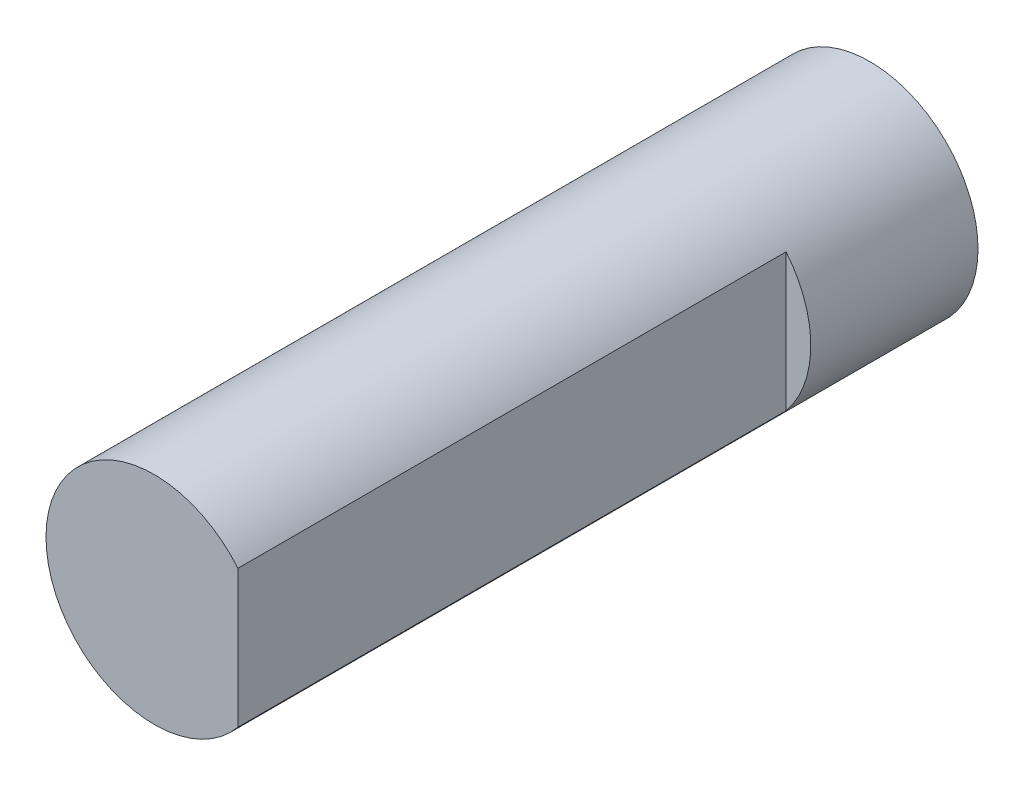
ISO-10303-21;
HEADER;
FILE_DESCRIPTION(('STEP AP214'),'2;1');
FILE_NAME('part.step','',(''),(''),'','','');
FILE_SCHEMA(('AUTOMOTIVE_DESIGN { 1 0 10303 214 1 1 1 1 }'));
ENDSEC;
DATA;
#1=APPLICATION_CONTEXT('core data for automotive mechanical design processes');
#2=APPLICATION_PROTOCOL_DEFINITION('international standard','automotive_design',2000,#1);
#3=PRODUCT_CONTEXT('',#1,'mechanical');
#4=PRODUCT('Part','Part','',(#3));
#5=PRODUCT_RELATED_PRODUCT_CATEGORY('part','',(#4));
#6=PRODUCT_DEFINITION_FORMATION('','',#4);
#7=PRODUCT_DEFINITION_CONTEXT('part definition',#1,'design');
#8=PRODUCT_DEFINITION('design','',#6,#7);
#9=PRODUCT_DEFINITION_SHAPE('','',#8);
#10=(LENGTH_UNIT() NAMED_UNIT(*) SI_UNIT(.MILLI.,.METRE.));
#11=(NAMED_UNIT(*) PLANE_ANGLE_UNIT() SI_UNIT($,.RADIAN.));
#12=(NAMED_UNIT(*) SI_UNIT($,.STERADIAN.) SOLID_ANGLE_UNIT());
#13=UNCERTAINTY_MEASURE_WITH_UNIT(LENGTH_MEASURE(1.E-05),#10,'distance_accuracy_value','');
#14=(GEOMETRIC_REPRESENTATION_CONTEXT(3) GLOBAL_UNCERTAINTY_ASSIGNED_CONTEXT((#13)) GLOBAL_UNIT_ASSIGNED_CONTEXT((#10,
#11,#12)) REPRESENTATION_CONTEXT('',''));
#15=CARTESIAN_POINT('',(0.,0.,0.));
#16=DIRECTION('',(0.,0.,1.));
#17=DIRECTION('',(1.,0.,0.));
#18=AXIS2_PLACEMENT_3D('',#15,#16,#17);
#19=CARTESIAN_POINT('',(0.,0.,67.65));
#20=DIRECTION('',(0.,0.,-1.));
#21=DIRECTION('',(-1.,0.,0.));
#22=AXIS2_PLACEMENT_3D('',#19,#20,#21);
#23=CYLINDRICAL_SURFACE('',#22,1.975);
#24=CARTESIAN_POINT('',(0.,0.,67.65));
#25=DIRECTION('',(0.,0.,1.));
#26=DIRECTION('',(1.,0.,0.));
#27=AXIS2_PLACEMENT_3D('',#24,#25,#26);
#28=CIRCLE('',#27,1.975);
#29=CARTESIAN_POINT('',(1.525,1.25499003980112,67.65));
#30=VERTEX_POINT('',#29);
#31=CARTESIAN_POINT('',(1.525,-1.25499003980112,67.65));
#32=VERTEX_POINT('',#31);
#33=EDGE_CURVE('E56',#30,#32,#28,.T.);
#34=ORIENTED_EDGE('',*,*,#33,.F.);
#35=DIRECTION('',(0.,0.,1.));
#36=VECTOR('',#35,1.);
#37=CARTESIAN_POINT('',(1.52499999999998,1.25499003980115,57.65));
#38=LINE('',#37,#36);
#39=CARTESIAN_POINT('',(1.52499999999998,1.25499003980115,57.65));
#40=VERTEX_POINT('',#39);
#41=EDGE_CURVE('E63',#40,#30,#38,.T.);
#42=ORIENTED_EDGE('',*,*,#41,.F.);
#43=CARTESIAN_POINT('',(0.,0.,57.65));
#44=DIRECTION('',(0.,0.,1.));
#45=DIRECTION('',(1.,0.,0.));
#46=AXIS2_PLACEMENT_3D('',#43,#44,#45);
#47=CIRCLE('',#46,1.975);
#48=CARTESIAN_POINT('',(1.52499999999997,-1.25499003980109,57.65));
#49=VERTEX_POINT('',#48);
#50=EDGE_CURVE('E13',#49,#40,#47,.T.);
#51=ORIENTED_EDGE('',*,*,#50,.F.);
#52=DIRECTION('',(0.,0.,1.));
#53=VECTOR('',#52,1.);
#54=CARTESIAN_POINT('',(1.52499999999997,-1.25499003980109,57.65));
#55=LINE('',#54,#53);
#56=EDGE_CURVE('E76',#49,#32,#55,.T.);
#57=ORIENTED_EDGE('',*,*,#56,.T.);
#58=EDGE_LOOP('',(#34,#42,#51,#57));
#59=FACE_BOUND('',#58,.T.);
#60=CARTESIAN_POINT('',(0.,0.,54.6));
#61=DIRECTION('',(0.,0.,1.));
#62=DIRECTION('',(1.,0.,0.));
#63=AXIS2_PLACEMENT_3D('',#60,#61,#62);
#64=CIRCLE('',#63,1.975);
#65=CARTESIAN_POINT('',(1.975,0.,54.6));
#66=VERTEX_POINT('',#65);
#67=EDGE_CURVE('E86',#66,#66,#64,.T.);
#68=ORIENTED_EDGE('',*,*,#67,.T.);
#69=EDGE_LOOP('',(#68));
#70=FACE_BOUND('',#69,.T.);
#71=ADVANCED_FACE('F49',(#59,#70),#23,.T.);
#72=CARTESIAN_POINT('',(0.,0.,67.65));
#73=DIRECTION('',(0.,0.,1.));
#74=DIRECTION('',(1.,0.,0.));
#75=AXIS2_PLACEMENT_3D('',#72,#73,#74);
#76=PLANE('',#75);
#77=DIRECTION('',(0.,-1.,0.));
#78=VECTOR('',#77,1.);
#79=CARTESIAN_POINT('',(1.52499999999996,0.,67.65));
#80=LINE('',#79,#78);
#81=EDGE_CURVE('E73',#30,#32,#80,.T.);
#82=ORIENTED_EDGE('',*,*,#81,.F.);
#83=ORIENTED_EDGE('',*,*,#33,.T.);
#84=EDGE_LOOP('',(#82,#83));
#85=FACE_BOUND('',#84,.T.);
#86=ADVANCED_FACE('F85',(#85),#76,.T.);
#87=CARTESIAN_POINT('',(0.,0.,54.6));
#88=DIRECTION('',(0.,0.,1.));
#89=DIRECTION('',(1.,0.,0.));
#90=AXIS2_PLACEMENT_3D('',#87,#88,#89);
#91=PLANE('',#90);
#92=ORIENTED_EDGE('',*,*,#67,.F.);
#93=EDGE_LOOP('',(#92));
#94=FACE_BOUND('',#93,.T.);
#95=ADVANCED_FACE('F93',(#94),#91,.F.);
#96=CARTESIAN_POINT('',(0.,0.,57.65));
#97=DIRECTION('',(0.,0.,1.));
#98=DIRECTION('',(1.,0.,0.));
#99=AXIS2_PLACEMENT_3D('',#96,#97,#98);
#100=PLANE('',#99);
#101=ORIENTED_EDGE('',*,*,#50,.T.);
#102=DIRECTION('',(0.,-1.,0.));
#103=VECTOR('',#102,1.);
#104=CARTESIAN_POINT('',(1.52499999999993,0.,57.65));
#105=LINE('',#104,#103);
#106=EDGE_CURVE('E80',#40,#49,#105,.T.);
#107=ORIENTED_EDGE('',*,*,#106,.T.);
#108=EDGE_LOOP('',(#101,#107));
#109=FACE_BOUND('',#108,.T.);
#110=ADVANCED_FACE('F91',(#109),#100,.T.);
#111=CARTESIAN_POINT('',(1.52499999999993,0.,57.65));
#112=DIRECTION('',(-1.,0.,0.));
#113=DIRECTION('',(0.,0.,1.));
#114=AXIS2_PLACEMENT_3D('',#111,#112,#113);
#115=PLANE('',#114);
#116=ORIENTED_EDGE('',*,*,#81,.T.);
#117=ORIENTED_EDGE('',*,*,#56,.F.);
#118=ORIENTED_EDGE('',*,*,#106,.F.);
#119=ORIENTED_EDGE('',*,*,#41,.T.);
#120=EDGE_LOOP('',(#116,#117,#118,#119));
#121=FACE_BOUND('',#120,.T.);
#122=ADVANCED_FACE('F75',(#121),#115,.F.);
#123=CLOSED_SHELL('',(#71,#86,#95,#110,#122));
#124=MANIFOLD_SOLID_BREP('B2',#123);
#125=ADVANCED_BREP_SHAPE_REPRESENTATION('',(#18,#124),#14);
#126=SHAPE_DEFINITION_REPRESENTATION(#9,#125);
ENDSEC;
END-ISO-10303-21;
